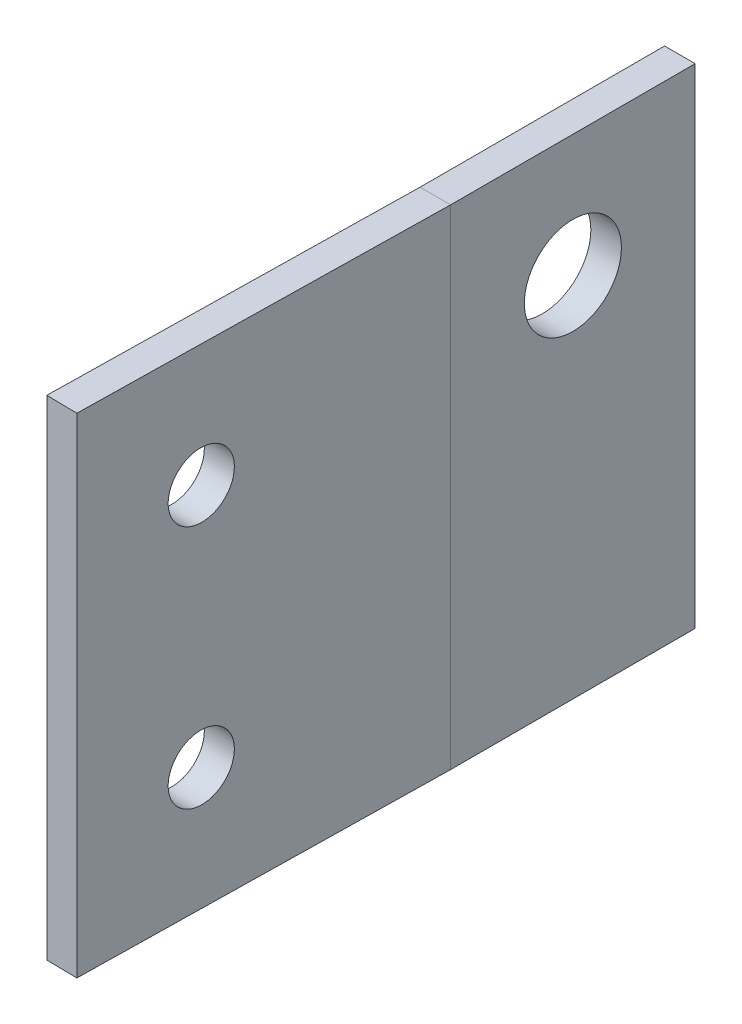
ISO-10303-21;
HEADER;
FILE_DESCRIPTION(('STEP AP214'),'2;1');
FILE_NAME('part.step','',(''),(''),'','','');
FILE_SCHEMA(('AUTOMOTIVE_DESIGN { 1 0 10303 214 1 1 1 1 }'));
ENDSEC;
DATA;
#1=APPLICATION_CONTEXT('core data for automotive mechanical design processes');
#2=APPLICATION_PROTOCOL_DEFINITION('international standard','automotive_design',2000,#1);
#3=PRODUCT_CONTEXT('',#1,'mechanical');
#4=PRODUCT('Part','Part','',(#3));
#5=PRODUCT_RELATED_PRODUCT_CATEGORY('part','',(#4));
#6=PRODUCT_DEFINITION_FORMATION('','',#4);
#7=PRODUCT_DEFINITION_CONTEXT('part definition',#1,'design');
#8=PRODUCT_DEFINITION('design','',#6,#7);
#9=PRODUCT_DEFINITION_SHAPE('','',#8);
#10=(LENGTH_UNIT() NAMED_UNIT(*) SI_UNIT(.MILLI.,.METRE.));
#11=(NAMED_UNIT(*) PLANE_ANGLE_UNIT() SI_UNIT($,.RADIAN.));
#12=(NAMED_UNIT(*) SI_UNIT($,.STERADIAN.) SOLID_ANGLE_UNIT());
#13=UNCERTAINTY_MEASURE_WITH_UNIT(LENGTH_MEASURE(1.E-05),#10,'distance_accuracy_value','');
#14=(GEOMETRIC_REPRESENTATION_CONTEXT(3) GLOBAL_UNCERTAINTY_ASSIGNED_CONTEXT((#13)) GLOBAL_UNIT_ASSIGNED_CONTEXT((#10,
#11,#12)) REPRESENTATION_CONTEXT('',''));
#15=CARTESIAN_POINT('',(0.,0.,0.));
#16=DIRECTION('',(0.,0.,1.));
#17=DIRECTION('',(1.,0.,0.));
#18=AXIS2_PLACEMENT_3D('',#15,#16,#17);
#19=CARTESIAN_POINT('',(3.175,-38.1,12.7));
#20=DIRECTION('',(0.,0.,-1.));
#21=DIRECTION('',(0.,1.,0.));
#22=AXIS2_PLACEMENT_3D('',#19,#20,#21);
#23=PLANE('',#22);
#24=DIRECTION('',(-1.,0.,0.));
#25=VECTOR('',#24,1.);
#26=CARTESIAN_POINT('',(3.175,12.7,12.7));
#27=LINE('',#26,#25);
#28=CARTESIAN_POINT('',(3.175,12.7,12.7));
#29=VERTEX_POINT('',#28);
#30=CARTESIAN_POINT('',(0.,12.7,12.7));
#31=VERTEX_POINT('',#30);
#32=EDGE_CURVE('E121',#29,#31,#27,.T.);
#33=ORIENTED_EDGE('',*,*,#32,.F.);
#34=DIRECTION('',(0.,1.,0.));
#35=VECTOR('',#34,1.);
#36=CARTESIAN_POINT('',(3.175,-38.1,12.7));
#37=LINE('',#36,#35);
#38=CARTESIAN_POINT('',(3.175,-38.1,12.7));
#39=VERTEX_POINT('',#38);
#40=EDGE_CURVE('E12',#39,#29,#37,.T.);
#41=ORIENTED_EDGE('',*,*,#40,.F.);
#42=DIRECTION('',(-1.,0.,0.));
#43=VECTOR('',#42,1.);
#44=CARTESIAN_POINT('',(3.175,-38.1,12.7));
#45=LINE('',#44,#43);
#46=CARTESIAN_POINT('',(0.,-38.1,12.7));
#47=VERTEX_POINT('',#46);
#48=EDGE_CURVE('E116',#39,#47,#45,.T.);
#49=ORIENTED_EDGE('',*,*,#48,.T.);
#50=DIRECTION('',(0.,1.,0.));
#51=VECTOR('',#50,1.);
#52=CARTESIAN_POINT('',(0.,-38.1,12.7));
#53=LINE('',#52,#51);
#54=EDGE_CURVE('E90',#47,#31,#53,.T.);
#55=ORIENTED_EDGE('',*,*,#54,.T.);
#56=EDGE_LOOP('',(#33,#41,#49,#55));
#57=FACE_BOUND('',#56,.T.);
#58=ADVANCED_FACE('F43',(#57),#23,.T.);
#59=CARTESIAN_POINT('',(3.175,-38.1,12.7277078052352));
#60=DIRECTION('',(1.,0.,0.));
#61=DIRECTION('',(0.,0.,-1.));
#62=AXIS2_PLACEMENT_3D('',#59,#60,#61);
#63=PLANE('',#62);
#64=DIRECTION('',(0.,0.,-1.));
#65=VECTOR('',#64,1.);
#66=CARTESIAN_POINT('',(3.175,12.7,12.7277078052352));
#67=LINE('',#66,#65);
#68=CARTESIAN_POINT('',(3.175,12.7,12.7277078052352));
#69=VERTEX_POINT('',#68);
#70=EDGE_CURVE('E131',#69,#29,#67,.T.);
#71=ORIENTED_EDGE('',*,*,#70,.F.);
#72=DIRECTION('',(0.,1.,0.));
#73=VECTOR('',#72,1.);
#74=CARTESIAN_POINT('',(3.175,-38.1,12.7277078052352));
#75=LINE('',#74,#73);
#76=CARTESIAN_POINT('',(3.175,-38.1,12.7277078052352));
#77=VERTEX_POINT('',#76);
#78=EDGE_CURVE('E52',#77,#69,#75,.T.);
#79=ORIENTED_EDGE('',*,*,#78,.F.);
#80=DIRECTION('',(0.,0.,-1.));
#81=VECTOR('',#80,1.);
#82=CARTESIAN_POINT('',(3.175,-38.1,12.7277078052352));
#83=LINE('',#82,#81);
#84=EDGE_CURVE('E111',#77,#39,#83,.T.);
#85=ORIENTED_EDGE('',*,*,#84,.T.);
#86=ORIENTED_EDGE('',*,*,#40,.T.);
#87=EDGE_LOOP('',(#71,#79,#85,#86));
#88=FACE_BOUND('',#87,.T.);
#89=ADVANCED_FACE('F138',(#88),#63,.T.);
#90=CARTESIAN_POINT('',(2.50957974686131,-38.1,50.8496085758969));
#91=DIRECTION('',(0.999847695156391,0.,0.0174524064372763));
#92=DIRECTION('',(0.0174524064372763,0.,-0.999847695156391));
#93=AXIS2_PLACEMENT_3D('',#90,#91,#92);
#94=PLANE('',#93);
#95=CARTESIAN_POINT('',(2.73122530861471,0.,38.1515428474107));
#96=DIRECTION('',(0.999847695156391,0.,0.0174524064372765));
#97=DIRECTION('',(0.0174524064372765,0.,-0.999847695156391));
#98=AXIS2_PLACEMENT_3D('',#95,#96,#97);
#99=CIRCLE('',#98,3.3782);
#100=CARTESIAN_POINT('',(2.79018302804112,0.,34.7738573636334));
#101=VERTEX_POINT('',#100);
#102=EDGE_CURVE('E167',#101,#101,#99,.T.);
#103=ORIENTED_EDGE('',*,*,#102,.F.);
#104=EDGE_LOOP('',(#103));
#105=FACE_BOUND('',#104,.T.);
#106=CARTESIAN_POINT('',(2.73122530861471,-25.4,38.1515428474107));
#107=DIRECTION('',(0.999847695156391,0.,0.0174524064372765));
#108=DIRECTION('',(0.0174524064372765,0.,-0.999847695156391));
#109=AXIS2_PLACEMENT_3D('',#106,#107,#108);
#110=CIRCLE('',#109,3.3782);
#111=CARTESIAN_POINT('',(2.79018302804112,-25.4,34.7738573636334));
#112=VERTEX_POINT('',#111);
#113=EDGE_CURVE('E162',#112,#112,#110,.T.);
#114=ORIENTED_EDGE('',*,*,#113,.F.);
#115=EDGE_LOOP('',(#114));
#116=FACE_BOUND('',#115,.T.);
#117=DIRECTION('',(0.0174524064372763,0.,-0.999847695156391));
#118=VECTOR('',#117,1.);
#119=CARTESIAN_POINT('',(2.50957974686131,12.7,50.8496085758969));
#120=LINE('',#119,#118);
#121=CARTESIAN_POINT('',(2.50957974686131,12.7,50.8496085758969));
#122=VERTEX_POINT('',#121);
#123=EDGE_CURVE('E100',#122,#69,#120,.T.);
#124=ORIENTED_EDGE('',*,*,#123,.F.);
#125=DIRECTION('',(0.,1.,0.));
#126=VECTOR('',#125,1.);
#127=CARTESIAN_POINT('',(2.50957974686131,-38.1,50.8496085758969));
#128=LINE('',#127,#126);
#129=CARTESIAN_POINT('',(2.50957974686131,-38.1,50.8496085758969));
#130=VERTEX_POINT('',#129);
#131=EDGE_CURVE('E95',#130,#122,#128,.T.);
#132=ORIENTED_EDGE('',*,*,#131,.F.);
#133=DIRECTION('',(0.0174524064372763,0.,-0.999847695156391));
#134=VECTOR('',#133,1.);
#135=CARTESIAN_POINT('',(2.50957974686131,-38.1,50.8496085758969));
#136=LINE('',#135,#134);
#137=EDGE_CURVE('E98',#130,#77,#136,.T.);
#138=ORIENTED_EDGE('',*,*,#137,.T.);
#139=ORIENTED_EDGE('',*,*,#78,.T.);
#140=EDGE_LOOP('',(#124,#132,#138,#139));
#141=FACE_BOUND('',#140,.T.);
#142=ADVANCED_FACE('F97',(#105,#116,#141),#94,.T.);
#143=CARTESIAN_POINT('',(-0.664936685260235,-38.1,50.7941971854585));
#144=DIRECTION('',(-0.0174524064372789,0.,0.999847695156391));
#145=DIRECTION('',(0.999847695156391,0.,0.0174524064372789));
#146=AXIS2_PLACEMENT_3D('',#143,#144,#145);
#147=PLANE('',#146);
#148=DIRECTION('',(0.999847695156391,0.,0.0174524064372789));
#149=VECTOR('',#148,1.);
#150=CARTESIAN_POINT('',(-0.664936685260235,12.7,50.7941971854585));
#151=LINE('',#150,#149);
#152=CARTESIAN_POINT('',(-0.664936685260235,12.7,50.7941971854585));
#153=VERTEX_POINT('',#152);
#154=EDGE_CURVE('E128',#153,#122,#151,.T.);
#155=ORIENTED_EDGE('',*,*,#154,.F.);
#156=DIRECTION('',(0.,1.,0.));
#157=VECTOR('',#156,1.);
#158=CARTESIAN_POINT('',(-0.664936685260235,-38.1,50.7941971854585));
#159=LINE('',#158,#157);
#160=CARTESIAN_POINT('',(-0.664936685260235,-38.1,50.7941971854585));
#161=VERTEX_POINT('',#160);
#162=EDGE_CURVE('E105',#161,#153,#159,.T.);
#163=ORIENTED_EDGE('',*,*,#162,.F.);
#164=DIRECTION('',(0.999847695156391,0.,0.0174524064372789));
#165=VECTOR('',#164,1.);
#166=CARTESIAN_POINT('',(-0.664936685260235,-38.1,50.7941971854585));
#167=LINE('',#166,#165);
#168=EDGE_CURVE('E110',#161,#130,#167,.T.);
#169=ORIENTED_EDGE('',*,*,#168,.T.);
#170=ORIENTED_EDGE('',*,*,#131,.T.);
#171=EDGE_LOOP('',(#155,#163,#169,#170));
#172=FACE_BOUND('',#171,.T.);
#173=ADVANCED_FACE('F113',(#172),#147,.T.);
#174=CARTESIAN_POINT('',(0.,-38.1,12.7));
#175=DIRECTION('',(-0.999847695156391,0.,-0.0174524064372765));
#176=DIRECTION('',(-0.0174524064372765,0.,0.999847695156391));
#177=AXIS2_PLACEMENT_3D('',#174,#175,#176);
#178=PLANE('',#177);
#179=CARTESIAN_POINT('',(-0.443291123506824,0.,38.0961314569723));
#180=DIRECTION('',(-0.999847695156391,0.,-0.0174524064372765));
#181=DIRECTION('',(-0.0174524064372765,0.,0.999847695156391));
#182=AXIS2_PLACEMENT_3D('',#179,#180,#181);
#183=CIRCLE('',#182,3.3782);
#184=CARTESIAN_POINT('',(-0.502248842933231,0.,41.4738169407497));
#185=VERTEX_POINT('',#184);
#186=EDGE_CURVE('E46',#185,#185,#183,.T.);
#187=ORIENTED_EDGE('',*,*,#186,.F.);
#188=EDGE_LOOP('',(#187));
#189=FACE_BOUND('',#188,.T.);
#190=CARTESIAN_POINT('',(-0.443291123506824,-25.4,38.0961314569723));
#191=DIRECTION('',(-0.999847695156391,0.,-0.0174524064372765));
#192=DIRECTION('',(-0.0174524064372765,0.,0.999847695156391));
#193=AXIS2_PLACEMENT_3D('',#190,#191,#192);
#194=CIRCLE('',#193,3.3782);
#195=CARTESIAN_POINT('',(-0.502248842933231,-25.4,41.4738169407497));
#196=VERTEX_POINT('',#195);
#197=EDGE_CURVE('E125',#196,#196,#194,.T.);
#198=ORIENTED_EDGE('',*,*,#197,.F.);
#199=EDGE_LOOP('',(#198));
#200=FACE_BOUND('',#199,.T.);
#201=DIRECTION('',(-0.0174524064372765,0.,0.999847695156391));
#202=VECTOR('',#201,1.);
#203=CARTESIAN_POINT('',(0.,12.7,12.7));
#204=LINE('',#203,#202);
#205=EDGE_CURVE('E124',#31,#153,#204,.T.);
#206=ORIENTED_EDGE('',*,*,#205,.F.);
#207=ORIENTED_EDGE('',*,*,#54,.F.);
#208=DIRECTION('',(-0.0174524064372765,0.,0.999847695156391));
#209=VECTOR('',#208,1.);
#210=CARTESIAN_POINT('',(0.,-38.1,12.7));
#211=LINE('',#210,#209);
#212=EDGE_CURVE('E114',#47,#161,#211,.T.);
#213=ORIENTED_EDGE('',*,*,#212,.T.);
#214=ORIENTED_EDGE('',*,*,#162,.T.);
#215=EDGE_LOOP('',(#206,#207,#213,#214));
#216=FACE_BOUND('',#215,.T.);
#217=ADVANCED_FACE('F135',(#189,#200,#216),#178,.T.);
#218=CARTESIAN_POINT('',(0.,-38.1,0.));
#219=DIRECTION('',(0.,-1.,0.));
#220=DIRECTION('',(0.,0.,-1.));
#221=AXIS2_PLACEMENT_3D('',#218,#219,#220);
#222=PLANE('',#221);
#223=ORIENTED_EDGE('',*,*,#48,.F.);
#224=ORIENTED_EDGE('',*,*,#84,.F.);
#225=ORIENTED_EDGE('',*,*,#137,.F.);
#226=ORIENTED_EDGE('',*,*,#168,.F.);
#227=ORIENTED_EDGE('',*,*,#212,.F.);
#228=EDGE_LOOP('',(#223,#224,#225,#226,#227));
#229=FACE_BOUND('',#228,.T.);
#230=ADVANCED_FACE('F109',(#229),#222,.T.);
#231=CARTESIAN_POINT('',(0.,12.7,0.));
#232=DIRECTION('',(0.,-1.,0.));
#233=DIRECTION('',(0.,0.,-1.));
#234=AXIS2_PLACEMENT_3D('',#231,#232,#233);
#235=PLANE('',#234);
#236=ORIENTED_EDGE('',*,*,#32,.T.);
#237=ORIENTED_EDGE('',*,*,#205,.T.);
#238=ORIENTED_EDGE('',*,*,#154,.T.);
#239=ORIENTED_EDGE('',*,*,#123,.T.);
#240=ORIENTED_EDGE('',*,*,#70,.T.);
#241=EDGE_LOOP('',(#236,#237,#238,#239,#240));
#242=FACE_BOUND('',#241,.T.);
#243=ADVANCED_FACE('F137',(#242),#235,.F.);
#244=CARTESIAN_POINT('',(2.73122530861471,-25.4,38.1515428474107));
#245=DIRECTION('',(0.999847695156391,0.,0.0174524064372765));
#246=DIRECTION('',(0.0174524064372765,0.,-0.999847695156391));
#247=AXIS2_PLACEMENT_3D('',#244,#245,#246);
#248=CYLINDRICAL_SURFACE('',#247,3.3782);
#249=ORIENTED_EDGE('',*,*,#197,.T.);
#250=EDGE_LOOP('',(#249));
#251=FACE_BOUND('',#250,.T.);
#252=ORIENTED_EDGE('',*,*,#113,.T.);
#253=EDGE_LOOP('',(#252));
#254=FACE_BOUND('',#253,.T.);
#255=ADVANCED_FACE('F174',(#251,#254),#248,.F.);
#256=CARTESIAN_POINT('',(2.73122530861471,0.,38.1515428474107));
#257=DIRECTION('',(0.999847695156391,0.,0.0174524064372765));
#258=DIRECTION('',(0.0174524064372765,0.,-0.999847695156391));
#259=AXIS2_PLACEMENT_3D('',#256,#257,#258);
#260=CYLINDRICAL_SURFACE('',#259,3.3782);
#261=ORIENTED_EDGE('',*,*,#186,.T.);
#262=EDGE_LOOP('',(#261));
#263=FACE_BOUND('',#262,.T.);
#264=ORIENTED_EDGE('',*,*,#102,.T.);
#265=EDGE_LOOP('',(#264));
#266=FACE_BOUND('',#265,.T.);
#267=ADVANCED_FACE('F172',(#263,#266),#260,.F.);
#268=CLOSED_SHELL('',(#58,#89,#142,#173,#217,#230,#243,#255,#267));
#269=MANIFOLD_SOLID_BREP('B2',#268);
#270=CARTESIAN_POINT('',(3.175,-38.1,12.7));
#271=DIRECTION('',(0.,0.,1.));
#272=DIRECTION('',(1.,0.,0.));
#273=AXIS2_PLACEMENT_3D('',#270,#271,#272);
#274=PLANE('',#273);
#275=DIRECTION('',(0.,1.,0.));
#276=VECTOR('',#275,1.);
#277=CARTESIAN_POINT('',(0.,-38.1,12.7));
#278=LINE('',#277,#276);
#279=CARTESIAN_POINT('',(0.,-38.1,12.7));
#280=VERTEX_POINT('',#279);
#281=CARTESIAN_POINT('',(0.,12.7,12.7));
#282=VERTEX_POINT('',#281);
#283=EDGE_CURVE('E300',#280,#282,#278,.T.);
#284=ORIENTED_EDGE('',*,*,#283,.F.);
#285=DIRECTION('',(-1.,0.,0.));
#286=VECTOR('',#285,1.);
#287=CARTESIAN_POINT('',(3.175,-38.1,12.7));
#288=LINE('',#287,#286);
#289=CARTESIAN_POINT('',(3.175,-38.1,12.7));
#290=VERTEX_POINT('',#289);
#291=EDGE_CURVE('E41',#290,#280,#288,.T.);
#292=ORIENTED_EDGE('',*,*,#291,.F.);
#293=DIRECTION('',(0.,1.,0.));
#294=VECTOR('',#293,1.);
#295=CARTESIAN_POINT('',(3.175,-38.1,12.7));
#296=LINE('',#295,#294);
#297=CARTESIAN_POINT('',(3.175,12.7,12.7));
#298=VERTEX_POINT('',#297);
#299=EDGE_CURVE('E293',#290,#298,#296,.T.);
#300=ORIENTED_EDGE('',*,*,#299,.T.);
#301=DIRECTION('',(-1.,0.,0.));
#302=VECTOR('',#301,1.);
#303=CARTESIAN_POINT('',(3.175,12.7,12.7));
#304=LINE('',#303,#302);
#305=EDGE_CURVE('E238',#298,#282,#304,.T.);
#306=ORIENTED_EDGE('',*,*,#305,.T.);
#307=EDGE_LOOP('',(#284,#292,#300,#306));
#308=FACE_BOUND('',#307,.T.);
#309=ADVANCED_FACE('F235',(#308),#274,.T.);
#310=CARTESIAN_POINT('',(3.175,-38.1,-12.7));
#311=DIRECTION('',(0.,-1.,0.));
#312=DIRECTION('',(0.,0.,-1.));
#313=AXIS2_PLACEMENT_3D('',#310,#311,#312);
#314=PLANE('',#313);
#315=DIRECTION('',(0.,0.,1.));
#316=VECTOR('',#315,1.);
#317=CARTESIAN_POINT('',(0.,-38.1,-12.7));
#318=LINE('',#317,#316);
#319=CARTESIAN_POINT('',(0.,-38.1,-12.7));
#320=VERTEX_POINT('',#319);
#321=EDGE_CURVE('E295',#320,#280,#318,.T.);
#322=ORIENTED_EDGE('',*,*,#321,.F.);
#323=DIRECTION('',(-1.,0.,0.));
#324=VECTOR('',#323,1.);
#325=CARTESIAN_POINT('',(3.175,-38.1,-12.7));
#326=LINE('',#325,#324);
#327=CARTESIAN_POINT('',(3.175,-38.1,-12.7));
#328=VERTEX_POINT('',#327);
#329=EDGE_CURVE('E244',#328,#320,#326,.T.);
#330=ORIENTED_EDGE('',*,*,#329,.F.);
#331=DIRECTION('',(0.,0.,1.));
#332=VECTOR('',#331,1.);
#333=CARTESIAN_POINT('',(3.175,-38.1,-12.7));
#334=LINE('',#333,#332);
#335=EDGE_CURVE('E290',#328,#290,#334,.T.);
#336=ORIENTED_EDGE('',*,*,#335,.T.);
#337=ORIENTED_EDGE('',*,*,#291,.T.);
#338=EDGE_LOOP('',(#322,#330,#336,#337));
#339=FACE_BOUND('',#338,.T.);
#340=ADVANCED_FACE('F311',(#339),#314,.T.);
#341=CARTESIAN_POINT('',(3.175,12.7,-12.7));
#342=DIRECTION('',(0.,0.,-1.));
#343=DIRECTION('',(0.,1.,0.));
#344=AXIS2_PLACEMENT_3D('',#341,#342,#343);
#345=PLANE('',#344);
#346=DIRECTION('',(0.,-1.,0.));
#347=VECTOR('',#346,1.);
#348=CARTESIAN_POINT('',(0.,12.7,-12.7));
#349=LINE('',#348,#347);
#350=CARTESIAN_POINT('',(0.,12.7,-12.7));
#351=VERTEX_POINT('',#350);
#352=EDGE_CURVE('E285',#351,#320,#349,.T.);
#353=ORIENTED_EDGE('',*,*,#352,.F.);
#354=DIRECTION('',(-1.,0.,0.));
#355=VECTOR('',#354,1.);
#356=CARTESIAN_POINT('',(3.175,12.7,-12.7));
#357=LINE('',#356,#355);
#358=CARTESIAN_POINT('',(3.175,12.7,-12.7));
#359=VERTEX_POINT('',#358);
#360=EDGE_CURVE('E280',#359,#351,#357,.T.);
#361=ORIENTED_EDGE('',*,*,#360,.F.);
#362=DIRECTION('',(0.,-1.,0.));
#363=VECTOR('',#362,1.);
#364=CARTESIAN_POINT('',(3.175,12.7,-12.7));
#365=LINE('',#364,#363);
#366=EDGE_CURVE('E283',#359,#328,#365,.T.);
#367=ORIENTED_EDGE('',*,*,#366,.T.);
#368=ORIENTED_EDGE('',*,*,#329,.T.);
#369=EDGE_LOOP('',(#353,#361,#367,#368));
#370=FACE_BOUND('',#369,.T.);
#371=ADVANCED_FACE('F282',(#370),#345,.T.);
#372=CARTESIAN_POINT('',(3.175,12.7,12.7));
#373=DIRECTION('',(0.,1.,0.));
#374=DIRECTION('',(0.,0.,1.));
#375=AXIS2_PLACEMENT_3D('',#372,#373,#374);
#376=PLANE('',#375);
#377=DIRECTION('',(0.,0.,-1.));
#378=VECTOR('',#377,1.);
#379=CARTESIAN_POINT('',(0.,12.7,12.7));
#380=LINE('',#379,#378);
#381=EDGE_CURVE('E303',#282,#351,#380,.T.);
#382=ORIENTED_EDGE('',*,*,#381,.F.);
#383=ORIENTED_EDGE('',*,*,#305,.F.);
#384=DIRECTION('',(0.,0.,-1.));
#385=VECTOR('',#384,1.);
#386=CARTESIAN_POINT('',(3.175,12.7,12.7));
#387=LINE('',#386,#385);
#388=EDGE_CURVE('E289',#298,#359,#387,.T.);
#389=ORIENTED_EDGE('',*,*,#388,.T.);
#390=ORIENTED_EDGE('',*,*,#360,.T.);
#391=EDGE_LOOP('',(#382,#383,#389,#390));
#392=FACE_BOUND('',#391,.T.);
#393=ADVANCED_FACE('F292',(#392),#376,.T.);
#394=CARTESIAN_POINT('',(3.175,0.,0.));
#395=DIRECTION('',(-1.,0.,0.));
#396=DIRECTION('',(0.,0.,1.));
#397=AXIS2_PLACEMENT_3D('',#394,#395,#396);
#398=PLANE('',#397);
#399=CARTESIAN_POINT('',(3.175,0.,0.));
#400=DIRECTION('',(1.,0.,0.));
#401=DIRECTION('',(0.,0.,-1.));
#402=AXIS2_PLACEMENT_3D('',#399,#400,#401);
#403=CIRCLE('',#402,5.0419);
#404=CARTESIAN_POINT('',(3.175,0.,-5.0419));
#405=VERTEX_POINT('',#404);
#406=EDGE_CURVE('E341',#405,#405,#403,.T.);
#407=ORIENTED_EDGE('',*,*,#406,.F.);
#408=EDGE_LOOP('',(#407));
#409=FACE_BOUND('',#408,.T.);
#410=ORIENTED_EDGE('',*,*,#299,.F.);
#411=ORIENTED_EDGE('',*,*,#335,.F.);
#412=ORIENTED_EDGE('',*,*,#366,.F.);
#413=ORIENTED_EDGE('',*,*,#388,.F.);
#414=EDGE_LOOP('',(#410,#411,#412,#413));
#415=FACE_BOUND('',#414,.T.);
#416=ADVANCED_FACE('F288',(#409,#415),#398,.F.);
#417=CARTESIAN_POINT('',(0.,0.,0.));
#418=DIRECTION('',(-1.,0.,0.));
#419=DIRECTION('',(0.,0.,1.));
#420=AXIS2_PLACEMENT_3D('',#417,#418,#419);
#421=PLANE('',#420);
#422=CARTESIAN_POINT('',(0.,0.,0.));
#423=DIRECTION('',(1.,0.,0.));
#424=DIRECTION('',(0.,0.,-1.));
#425=AXIS2_PLACEMENT_3D('',#422,#423,#424);
#426=CIRCLE('',#425,5.0419);
#427=CARTESIAN_POINT('',(0.,0.,-5.0419));
#428=VERTEX_POINT('',#427);
#429=EDGE_CURVE('E304',#428,#428,#426,.T.);
#430=ORIENTED_EDGE('',*,*,#429,.T.);
#431=EDGE_LOOP('',(#430));
#432=FACE_BOUND('',#431,.T.);
#433=ORIENTED_EDGE('',*,*,#283,.T.);
#434=ORIENTED_EDGE('',*,*,#381,.T.);
#435=ORIENTED_EDGE('',*,*,#352,.T.);
#436=ORIENTED_EDGE('',*,*,#321,.T.);
#437=EDGE_LOOP('',(#433,#434,#435,#436));
#438=FACE_BOUND('',#437,.T.);
#439=ADVANCED_FACE('F310',(#432,#438),#421,.T.);
#440=CARTESIAN_POINT('',(3.175,0.,0.));
#441=DIRECTION('',(1.,0.,0.));
#442=DIRECTION('',(0.,0.,-1.));
#443=AXIS2_PLACEMENT_3D('',#440,#441,#442);
#444=CYLINDRICAL_SURFACE('',#443,5.0419);
#445=ORIENTED_EDGE('',*,*,#429,.F.);
#446=EDGE_LOOP('',(#445));
#447=FACE_BOUND('',#446,.T.);
#448=ORIENTED_EDGE('',*,*,#406,.T.);
#449=EDGE_LOOP('',(#448));
#450=FACE_BOUND('',#449,.T.);
#451=ADVANCED_FACE('F329',(#447,#450),#444,.F.);
#452=CLOSED_SHELL('',(#309,#340,#371,#393,#416,#439,#451));
#453=MANIFOLD_SOLID_BREP('B6',#452);
#454=ADVANCED_BREP_SHAPE_REPRESENTATION('',(#18,#269,#453),#14);
#455=SHAPE_DEFINITION_REPRESENTATION(#9,#454);
ENDSEC;
END-ISO-10303-21;
